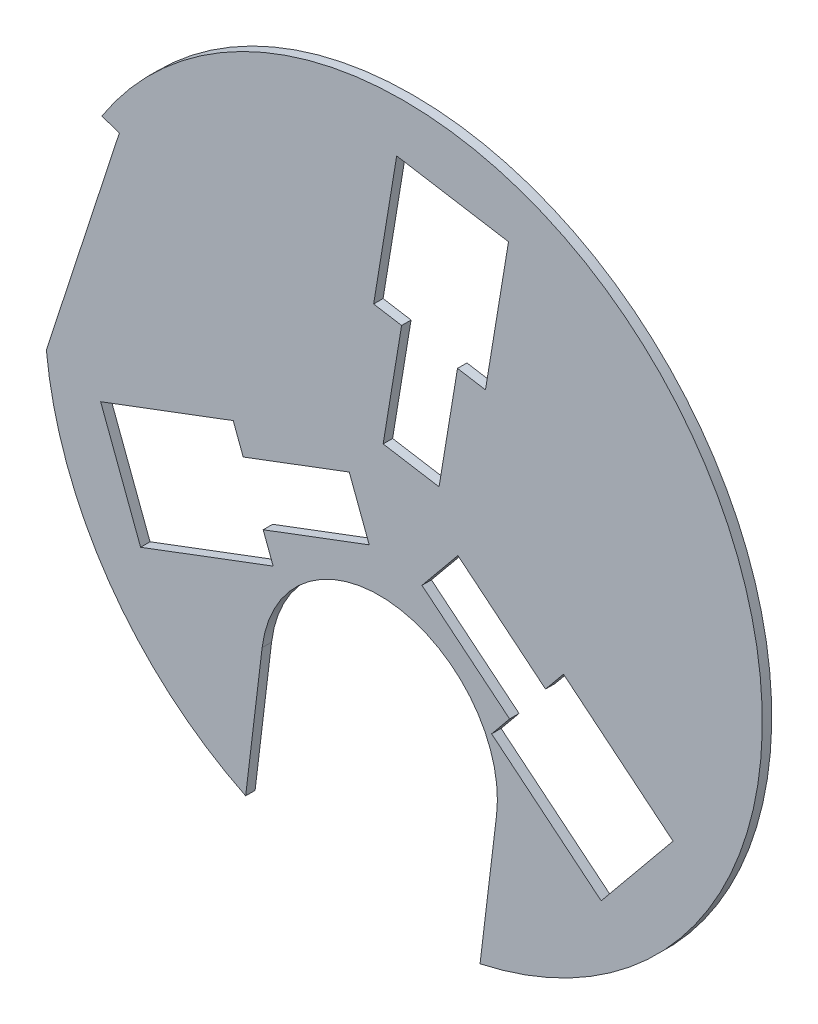
ISO-10303-21;
HEADER;
FILE_DESCRIPTION(('STEP AP214'),'2;1');
FILE_NAME('part.step','',(''),(''),'','','');
FILE_SCHEMA(('AUTOMOTIVE_DESIGN { 1 0 10303 214 1 1 1 1 }'));
ENDSEC;
DATA;
#1=APPLICATION_CONTEXT('core data for automotive mechanical design processes');
#2=APPLICATION_PROTOCOL_DEFINITION('international standard','automotive_design',2000,#1);
#3=PRODUCT_CONTEXT('',#1,'mechanical');
#4=PRODUCT('Part','Part','',(#3));
#5=PRODUCT_RELATED_PRODUCT_CATEGORY('part','',(#4));
#6=PRODUCT_DEFINITION_FORMATION('','',#4);
#7=PRODUCT_DEFINITION_CONTEXT('part definition',#1,'design');
#8=PRODUCT_DEFINITION('design','',#6,#7);
#9=PRODUCT_DEFINITION_SHAPE('','',#8);
#10=(LENGTH_UNIT() NAMED_UNIT(*) SI_UNIT(.MILLI.,.METRE.));
#11=(NAMED_UNIT(*) PLANE_ANGLE_UNIT() SI_UNIT($,.RADIAN.));
#12=(NAMED_UNIT(*) SI_UNIT($,.STERADIAN.) SOLID_ANGLE_UNIT());
#13=UNCERTAINTY_MEASURE_WITH_UNIT(LENGTH_MEASURE(1.E-05),#10,'distance_accuracy_value','');
#14=(GEOMETRIC_REPRESENTATION_CONTEXT(3) GLOBAL_UNCERTAINTY_ASSIGNED_CONTEXT((#13)) GLOBAL_UNIT_ASSIGNED_CONTEXT((#10,
#11,#12)) REPRESENTATION_CONTEXT('',''));
#15=CARTESIAN_POINT('',(0.,0.,0.));
#16=DIRECTION('',(0.,0.,1.));
#17=DIRECTION('',(1.,0.,0.));
#18=AXIS2_PLACEMENT_3D('',#15,#16,#17);
#19=CARTESIAN_POINT('',(0.,0.,5.));
#20=DIRECTION('',(0.,0.,1.));
#21=DIRECTION('',(1.,0.,0.));
#22=AXIS2_PLACEMENT_3D('',#19,#20,#21);
#23=PLANE('',#22);
#24=CARTESIAN_POINT('',(0.,0.,5.));
#25=DIRECTION('',(0.,0.,1.));
#26=DIRECTION('',(1.,0.,0.));
#27=AXIS2_PLACEMENT_3D('',#24,#25,#26);
#28=CIRCLE('',#27,190.);
#29=CARTESIAN_POINT('',(40.570349206141,-185.618013041008,5.));
#30=VERTEX_POINT('',#29);
#31=CARTESIAN_POINT('',(-159.704253128849,102.929837911835,5.));
#32=VERTEX_POINT('',#31);
#33=EDGE_CURVE('E419',#30,#32,#28,.T.);
#34=ORIENTED_EDGE('',*,*,#33,.T.);
#35=DIRECTION('',(0.950945587746188,-0.309358189072241,0.));
#36=VECTOR('',#35,1.);
#37=CARTESIAN_POINT('',(-150.380705264595,99.8967349455023,5.));
#38=LINE('',#37,#36);
#39=CARTESIAN_POINT('',(-150.380705264595,99.8967349455023,5.));
#40=VERTEX_POINT('',#39);
#41=EDGE_CURVE('E422',#32,#40,#38,.T.);
#42=ORIENTED_EDGE('',*,*,#41,.T.);
#43=DIRECTION('',(-0.309358189072243,-0.950945587746188,0.));
#44=VECTOR('',#43,1.);
#45=CARTESIAN_POINT('',(-189.050478898635,-18.9714635228006,5.));
#46=LINE('',#45,#44);
#47=CARTESIAN_POINT('',(-189.050478898635,-18.9714635228006,5.));
#48=VERTEX_POINT('',#47);
#49=EDGE_CURVE('E425',#40,#48,#46,.T.);
#50=ORIENTED_EDGE('',*,*,#49,.T.);
#51=CARTESIAN_POINT('',(0.,0.,5.));
#52=DIRECTION('',(0.,0.,1.));
#53=DIRECTION('',(1.,0.,0.));
#54=AXIS2_PLACEMENT_3D('',#51,#52,#53);
#55=CIRCLE('',#54,190.);
#56=CARTESIAN_POINT('',(-83.5306748229821,-170.6535272522,5.));
#57=VERTEX_POINT('',#56);
#58=EDGE_CURVE('E427',#48,#57,#55,.T.);
#59=ORIENTED_EDGE('',*,*,#58,.T.);
#60=DIRECTION('',(0.119716053921263,0.992808172021928,0.));
#61=VECTOR('',#60,1.);
#62=CARTESIAN_POINT('',(-83.5306748229821,-170.6535272522,5.));
#63=LINE('',#62,#61);
#64=CARTESIAN_POINT('',(-74.8066287928856,-98.3047995078674,5.));
#65=VERTEX_POINT('',#64);
#66=EDGE_CURVE('E429',#57,#65,#63,.T.);
#67=ORIENTED_EDGE('',*,*,#66,.T.);
#68=CARTESIAN_POINT('',(-12.7561167798487,-105.787042414917,5.));
#69=DIRECTION('',(0.,0.,-1.));
#70=DIRECTION('',(1.,0.,0.));
#71=AXIS2_PLACEMENT_3D('',#68,#69,#70);
#72=CIRCLE('',#71,62.5000000000009);
#73=CARTESIAN_POINT('',(49.2943952362377,-113.269285296676,5.));
#74=VERTEX_POINT('',#73);
#75=EDGE_CURVE('E431',#65,#74,#72,.T.);
#76=ORIENTED_EDGE('',*,*,#75,.T.);
#77=DIRECTION('',(-0.119716053921264,-0.992808172021927,0.));
#78=VECTOR('',#77,1.);
#79=CARTESIAN_POINT('',(40.570349206141,-185.618013041008,5.));
#80=LINE('',#79,#78);
#81=EDGE_CURVE('E433',#74,#30,#80,.T.);
#82=ORIENTED_EDGE('',*,*,#81,.T.);
#83=EDGE_LOOP('',(#34,#42,#50,#59,#67,#76,#82));
#84=FACE_BOUND('',#83,.T.);
#85=DIRECTION('',(0.935818277582304,0.35248283836648,0.));
#86=VECTOR('',#85,1.);
#87=CARTESIAN_POINT('',(-139.156439262174,-84.4718024661059,5.));
#88=LINE('',#87,#86);
#89=CARTESIAN_POINT('',(-139.156439262174,-84.4718024661059,5.));
#90=VERTEX_POINT('',#89);
#91=CARTESIAN_POINT('',(-68.9700684435015,-58.0355895886199,5.));
#92=VERTEX_POINT('',#91);
#93=EDGE_CURVE('E362',#90,#92,#88,.T.);
#94=ORIENTED_EDGE('',*,*,#93,.F.);
#95=DIRECTION('',(0.35248283836648,-0.935818277582304,0.));
#96=VECTOR('',#95,1.);
#97=CARTESIAN_POINT('',(-160.305409564163,-28.3227058111676,5.));
#98=LINE('',#97,#96);
#99=CARTESIAN_POINT('',(-160.305409564163,-28.3227058111676,5.));
#100=VERTEX_POINT('',#99);
#101=EDGE_CURVE('E360',#100,#90,#98,.T.);
#102=ORIENTED_EDGE('',*,*,#101,.F.);
#103=DIRECTION('',(-0.935818277582304,-0.352482838366479,0.));
#104=VECTOR('',#103,1.);
#105=CARTESIAN_POINT('',(-160.305409564163,-28.3227058111676,5.));
#106=LINE('',#105,#104);
#107=CARTESIAN_POINT('',(-90.1190387454903,-1.88649293368167,5.));
#108=VERTEX_POINT('',#107);
#109=EDGE_CURVE('E376',#108,#100,#106,.T.);
#110=ORIENTED_EDGE('',*,*,#109,.F.);
#111=DIRECTION('',(-0.352482838366482,0.935818277582303,0.));
#112=VECTOR('',#111,1.);
#113=CARTESIAN_POINT('',(-90.1190387454903,-1.88649293368167,5.));
#114=LINE('',#113,#112);
#115=CARTESIAN_POINT('',(-84.8317961699931,-15.9237670974162,5.));
#116=VERTEX_POINT('',#115);
#117=EDGE_CURVE('E373',#116,#108,#114,.T.);
#118=ORIENTED_EDGE('',*,*,#117,.F.);
#119=DIRECTION('',(-0.935818277582304,-0.352482838366479,0.));
#120=VECTOR('',#119,1.);
#121=CARTESIAN_POINT('',(-84.8317961699931,-15.9237670974162,5.));
#122=LINE('',#121,#120);
#123=CARTESIAN_POINT('',(-28.6826995150548,5.22520320457257,5.));
#124=VERTEX_POINT('',#123);
#125=EDGE_CURVE('E371',#124,#116,#122,.T.);
#126=ORIENTED_EDGE('',*,*,#125,.F.);
#127=DIRECTION('',(-0.35248283836648,0.935818277582304,0.));
#128=VECTOR('',#127,1.);
#129=CARTESIAN_POINT('',(-28.6826995150548,5.22520320457257,5.));
#130=LINE('',#129,#128);
#131=CARTESIAN_POINT('',(-18.1082143640604,-22.8493451228966,5.));
#132=VERTEX_POINT('',#131);
#133=EDGE_CURVE('E369',#132,#124,#130,.T.);
#134=ORIENTED_EDGE('',*,*,#133,.F.);
#135=DIRECTION('',(0.935818277582304,0.35248283836648,0.));
#136=VECTOR('',#135,1.);
#137=CARTESIAN_POINT('',(-74.2573110189986,-43.9983154248853,5.));
#138=LINE('',#137,#136);
#139=CARTESIAN_POINT('',(-74.2573110189986,-43.9983154248853,5.));
#140=VERTEX_POINT('',#139);
#141=EDGE_CURVE('E367',#140,#132,#138,.T.);
#142=ORIENTED_EDGE('',*,*,#141,.F.);
#143=DIRECTION('',(-0.352482838366478,0.935818277582305,0.));
#144=VECTOR('',#143,1.);
#145=CARTESIAN_POINT('',(-74.2573110189986,-43.9983154248853,5.));
#146=LINE('',#145,#144);
#147=EDGE_CURVE('E365',#92,#140,#146,.T.);
#148=ORIENTED_EDGE('',*,*,#147,.F.);
#149=EDGE_LOOP('',(#94,#102,#110,#118,#126,#134,#142,#148));
#150=FACE_BOUND('',#149,.T.);
#151=DIRECTION('',(-0.162650046367733,-0.986683820895313,0.));
#152=VECTOR('',#151,1.);
#153=CARTESIAN_POINT('',(-3.57650720802196,162.748912734283,5.));
#154=LINE('',#153,#152);
#155=CARTESIAN_POINT('',(-3.57650720802196,162.748912734283,5.));
#156=VERTEX_POINT('',#155);
#157=CARTESIAN_POINT('',(-15.7752606856019,88.7476261671346,5.));
#158=VERTEX_POINT('',#157);
#159=EDGE_CURVE('E303',#156,#158,#154,.T.);
#160=ORIENTED_EDGE('',*,*,#159,.F.);
#161=DIRECTION('',(-0.986683820895313,0.162650046367733,0.));
#162=VECTOR('',#161,1.);
#163=CARTESIAN_POINT('',(55.6245220456968,152.989909952219,5.));
#164=LINE('',#163,#162);
#165=CARTESIAN_POINT('',(55.6245220456968,152.989909952219,5.));
#166=VERTEX_POINT('',#165);
#167=EDGE_CURVE('E301',#166,#156,#164,.T.);
#168=ORIENTED_EDGE('',*,*,#167,.F.);
#169=DIRECTION('',(0.162650046367733,0.986683820895313,0.));
#170=VECTOR('',#169,1.);
#171=CARTESIAN_POINT('',(55.6245220456968,152.989909952219,5.));
#172=LINE('',#171,#170);
#173=CARTESIAN_POINT('',(43.4257685681168,78.9886233850706,5.));
#174=VERTEX_POINT('',#173);
#175=EDGE_CURVE('E317',#174,#166,#172,.T.);
#176=ORIENTED_EDGE('',*,*,#175,.F.);
#177=DIRECTION('',(0.986683820895313,-0.162650046367734,0.));
#178=VECTOR('',#177,1.);
#179=CARTESIAN_POINT('',(43.4257685681168,78.9886233850706,5.));
#180=LINE('',#179,#178);
#181=CARTESIAN_POINT('',(28.6255112546872,81.4283740805867,5.));
#182=VERTEX_POINT('',#181);
#183=EDGE_CURVE('E314',#182,#174,#180,.T.);
#184=ORIENTED_EDGE('',*,*,#183,.F.);
#185=DIRECTION('',(0.162650046367733,0.986683820895313,0.));
#186=VECTOR('',#185,1.);
#187=CARTESIAN_POINT('',(28.6255112546872,81.4283740805867,5.));
#188=LINE('',#187,#186);
#189=CARTESIAN_POINT('',(18.866508472623,22.2273448268668,5.));
#190=VERTEX_POINT('',#189);
#191=EDGE_CURVE('E312',#190,#182,#188,.T.);
#192=ORIENTED_EDGE('',*,*,#191,.F.);
#193=DIRECTION('',(0.986683820895313,-0.162650046367733,0.));
#194=VECTOR('',#193,1.);
#195=CARTESIAN_POINT('',(18.866508472623,22.2273448268668,5.));
#196=LINE('',#195,#194);
#197=CARTESIAN_POINT('',(-10.7340061542364,27.1068462178988,5.));
#198=VERTEX_POINT('',#197);
#199=EDGE_CURVE('E310',#198,#190,#196,.T.);
#200=ORIENTED_EDGE('',*,*,#199,.F.);
#201=DIRECTION('',(-0.162650046367733,-0.986683820895313,0.));
#202=VECTOR('',#201,1.);
#203=CARTESIAN_POINT('',(-0.975003372172222,86.3078754716186,5.));
#204=LINE('',#203,#202);
#205=CARTESIAN_POINT('',(-0.975003372172222,86.3078754716186,5.));
#206=VERTEX_POINT('',#205);
#207=EDGE_CURVE('E308',#206,#198,#204,.T.);
#208=ORIENTED_EDGE('',*,*,#207,.F.);
#209=DIRECTION('',(0.986683820895313,-0.162650046367732,0.));
#210=VECTOR('',#209,1.);
#211=CARTESIAN_POINT('',(-0.975003372172222,86.3078754716186,5.));
#212=LINE('',#211,#210);
#213=EDGE_CURVE('E306',#158,#206,#212,.T.);
#214=ORIENTED_EDGE('',*,*,#213,.F.);
#215=EDGE_LOOP('',(#160,#168,#176,#184,#192,#200,#208,#214));
#216=FACE_BOUND('',#215,.T.);
#217=DIRECTION('',(-0.773168231214567,0.634200982528833,0.));
#218=VECTOR('',#217,1.);
#219=CARTESIAN_POINT('',(142.732946470196,-78.2771102681759,5.));
#220=LINE('',#219,#218);
#221=CARTESIAN_POINT('',(142.732946470196,-78.2771102681759,5.));
#222=VERTEX_POINT('',#221);
#223=CARTESIAN_POINT('',(84.7453291291034,-30.7120365785134,5.));
#224=VERTEX_POINT('',#223);
#225=EDGE_CURVE('E244',#222,#224,#220,.T.);
#226=ORIENTED_EDGE('',*,*,#225,.F.);
#227=DIRECTION('',(0.634200982528834,0.773168231214567,0.));
#228=VECTOR('',#227,1.);
#229=CARTESIAN_POINT('',(104.680887518465,-124.667204141051,5.));
#230=LINE('',#229,#228);
#231=CARTESIAN_POINT('',(104.680887518465,-124.667204141051,5.));
#232=VERTEX_POINT('',#231);
#233=EDGE_CURVE('E236',#232,#222,#230,.T.);
#234=ORIENTED_EDGE('',*,*,#233,.F.);
#235=DIRECTION('',(0.773168231214567,-0.634200982528833,0.));
#236=VECTOR('',#235,1.);
#237=CARTESIAN_POINT('',(104.680887518465,-124.667204141051,5.));
#238=LINE('',#237,#236);
#239=CARTESIAN_POINT('',(46.6932701773728,-77.1021304513881,5.));
#240=VERTEX_POINT('',#239);
#241=EDGE_CURVE('E269',#240,#232,#238,.T.);
#242=ORIENTED_EDGE('',*,*,#241,.F.);
#243=DIRECTION('',(-0.634200982528833,-0.773168231214568,0.));
#244=VECTOR('',#243,1.);
#245=CARTESIAN_POINT('',(46.6932701773728,-77.1021304513881,5.));
#246=LINE('',#245,#244);
#247=CARTESIAN_POINT('',(56.2062849153056,-65.5046069831693,5.));
#248=VERTEX_POINT('',#247);
#249=EDGE_CURVE('E267',#248,#240,#246,.T.);
#250=ORIENTED_EDGE('',*,*,#249,.F.);
#251=DIRECTION('',(0.773168231214567,-0.634200982528834,0.));
#252=VECTOR('',#251,1.);
#253=CARTESIAN_POINT('',(56.2062849153056,-65.5046069831693,5.));
#254=LINE('',#253,#252);
#255=CARTESIAN_POINT('',(9.81619104243168,-27.4525480314393,5.));
#256=VERTEX_POINT('',#255);
#257=EDGE_CURVE('E265',#256,#248,#254,.T.);
#258=ORIENTED_EDGE('',*,*,#257,.F.);
#259=DIRECTION('',(-0.634200982528834,-0.773168231214567,0.));
#260=VECTOR('',#259,1.);
#261=CARTESIAN_POINT('',(9.81619104243168,-27.4525480314393,5.));
#262=LINE('',#261,#260);
#263=CARTESIAN_POINT('',(28.8422205182967,-4.25750109500233,5.));
#264=VERTEX_POINT('',#263);
#265=EDGE_CURVE('E263',#264,#256,#262,.T.);
#266=ORIENTED_EDGE('',*,*,#265,.F.);
#267=DIRECTION('',(-0.773168231214567,0.634200982528834,0.));
#268=VECTOR('',#267,1.);
#269=CARTESIAN_POINT('',(75.2323143911706,-42.3095600467323,5.));
#270=LINE('',#269,#268);
#271=CARTESIAN_POINT('',(75.2323143911706,-42.3095600467323,5.));
#272=VERTEX_POINT('',#271);
#273=EDGE_CURVE('E259',#272,#264,#270,.T.);
#274=ORIENTED_EDGE('',*,*,#273,.F.);
#275=DIRECTION('',(-0.634200982528834,-0.773168231214567,0.));
#276=VECTOR('',#275,1.);
#277=CARTESIAN_POINT('',(75.2323143911706,-42.3095600467323,5.));
#278=LINE('',#277,#276);
#279=EDGE_CURVE('E257',#224,#272,#278,.T.);
#280=ORIENTED_EDGE('',*,*,#279,.F.);
#281=EDGE_LOOP('',(#226,#234,#242,#250,#258,#266,#274,#280));
#282=FACE_BOUND('',#281,.T.);
#283=ADVANCED_FACE('F33',(#84,#150,#216,#282),#23,.T.);
#284=CARTESIAN_POINT('',(0.,0.,0.));
#285=DIRECTION('',(0.,0.,1.));
#286=DIRECTION('',(1.,0.,0.));
#287=AXIS2_PLACEMENT_3D('',#284,#285,#286);
#288=PLANE('',#287);
#289=DIRECTION('',(-0.986683820895313,0.162650046367733,0.));
#290=VECTOR('',#289,1.);
#291=CARTESIAN_POINT('',(55.6245220456968,152.989909952219,0.));
#292=LINE('',#291,#290);
#293=CARTESIAN_POINT('',(55.6245220456968,152.989909952219,0.));
#294=VERTEX_POINT('',#293);
#295=CARTESIAN_POINT('',(-3.57650720802196,162.748912734283,0.));
#296=VERTEX_POINT('',#295);
#297=EDGE_CURVE('E252',#294,#296,#292,.T.);
#298=ORIENTED_EDGE('',*,*,#297,.T.);
#299=DIRECTION('',(-0.162650046367733,-0.986683820895313,0.));
#300=VECTOR('',#299,1.);
#301=CARTESIAN_POINT('',(-3.57650720802196,162.748912734283,0.));
#302=LINE('',#301,#300);
#303=CARTESIAN_POINT('',(-15.7752606856019,88.7476261671346,0.));
#304=VERTEX_POINT('',#303);
#305=EDGE_CURVE('E322',#296,#304,#302,.T.);
#306=ORIENTED_EDGE('',*,*,#305,.T.);
#307=DIRECTION('',(0.986683820895313,-0.162650046367732,0.));
#308=VECTOR('',#307,1.);
#309=CARTESIAN_POINT('',(-0.975003372172222,86.3078754716186,0.));
#310=LINE('',#309,#308);
#311=CARTESIAN_POINT('',(-0.975003372172222,86.3078754716186,0.));
#312=VERTEX_POINT('',#311);
#313=EDGE_CURVE('E325',#304,#312,#310,.T.);
#314=ORIENTED_EDGE('',*,*,#313,.T.);
#315=DIRECTION('',(-0.162650046367733,-0.986683820895313,0.));
#316=VECTOR('',#315,1.);
#317=CARTESIAN_POINT('',(-0.975003372172222,86.3078754716186,0.));
#318=LINE('',#317,#316);
#319=CARTESIAN_POINT('',(-10.7340061542364,27.1068462178988,0.));
#320=VERTEX_POINT('',#319);
#321=EDGE_CURVE('E328',#312,#320,#318,.T.);
#322=ORIENTED_EDGE('',*,*,#321,.T.);
#323=DIRECTION('',(0.986683820895313,-0.162650046367733,0.));
#324=VECTOR('',#323,1.);
#325=CARTESIAN_POINT('',(18.866508472623,22.2273448268668,0.));
#326=LINE('',#325,#324);
#327=CARTESIAN_POINT('',(18.866508472623,22.2273448268668,0.));
#328=VERTEX_POINT('',#327);
#329=EDGE_CURVE('E331',#320,#328,#326,.T.);
#330=ORIENTED_EDGE('',*,*,#329,.T.);
#331=DIRECTION('',(0.162650046367733,0.986683820895313,0.));
#332=VECTOR('',#331,1.);
#333=CARTESIAN_POINT('',(28.6255112546872,81.4283740805867,0.));
#334=LINE('',#333,#332);
#335=CARTESIAN_POINT('',(28.6255112546872,81.4283740805867,0.));
#336=VERTEX_POINT('',#335);
#337=EDGE_CURVE('E334',#328,#336,#334,.T.);
#338=ORIENTED_EDGE('',*,*,#337,.T.);
#339=DIRECTION('',(0.986683820895313,-0.162650046367734,0.));
#340=VECTOR('',#339,1.);
#341=CARTESIAN_POINT('',(43.4257685681168,78.9886233850706,0.));
#342=LINE('',#341,#340);
#343=CARTESIAN_POINT('',(43.4257685681168,78.9886233850706,0.));
#344=VERTEX_POINT('',#343);
#345=EDGE_CURVE('E337',#336,#344,#342,.T.);
#346=ORIENTED_EDGE('',*,*,#345,.T.);
#347=DIRECTION('',(0.162650046367733,0.986683820895313,0.));
#348=VECTOR('',#347,1.);
#349=CARTESIAN_POINT('',(55.6245220456968,152.989909952219,0.));
#350=LINE('',#349,#348);
#351=EDGE_CURVE('E304',#344,#294,#350,.T.);
#352=ORIENTED_EDGE('',*,*,#351,.T.);
#353=EDGE_LOOP('',(#298,#306,#314,#322,#330,#338,#346,#352));
#354=FACE_BOUND('',#353,.T.);
#355=CARTESIAN_POINT('',(0.,0.,0.));
#356=DIRECTION('',(0.,0.,1.));
#357=DIRECTION('',(1.,0.,0.));
#358=AXIS2_PLACEMENT_3D('',#355,#356,#357);
#359=CIRCLE('',#358,190.);
#360=CARTESIAN_POINT('',(40.570349206141,-185.618013041008,0.));
#361=VERTEX_POINT('',#360);
#362=CARTESIAN_POINT('',(-159.704253128849,102.929837911835,0.));
#363=VERTEX_POINT('',#362);
#364=EDGE_CURVE('E418',#361,#363,#359,.T.);
#365=ORIENTED_EDGE('',*,*,#364,.F.);
#366=DIRECTION('',(-0.119716053921264,-0.992808172021927,0.));
#367=VECTOR('',#366,1.);
#368=CARTESIAN_POINT('',(40.570349206141,-185.618013041008,0.));
#369=LINE('',#368,#367);
#370=CARTESIAN_POINT('',(49.2943952362377,-113.269285296676,0.));
#371=VERTEX_POINT('',#370);
#372=EDGE_CURVE('E423',#371,#361,#369,.T.);
#373=ORIENTED_EDGE('',*,*,#372,.F.);
#374=CARTESIAN_POINT('',(-12.7561167798487,-105.787042414917,0.));
#375=DIRECTION('',(0.,0.,-1.));
#376=DIRECTION('',(1.,0.,0.));
#377=AXIS2_PLACEMENT_3D('',#374,#375,#376);
#378=CIRCLE('',#377,62.5000000000009);
#379=CARTESIAN_POINT('',(-74.8066287928856,-98.3047995078674,0.));
#380=VERTEX_POINT('',#379);
#381=EDGE_CURVE('E446',#380,#371,#378,.T.);
#382=ORIENTED_EDGE('',*,*,#381,.F.);
#383=DIRECTION('',(0.119716053921263,0.992808172021928,0.));
#384=VECTOR('',#383,1.);
#385=CARTESIAN_POINT('',(-83.5306748229821,-170.6535272522,0.));
#386=LINE('',#385,#384);
#387=CARTESIAN_POINT('',(-83.5306748229821,-170.6535272522,0.));
#388=VERTEX_POINT('',#387);
#389=EDGE_CURVE('E444',#388,#380,#386,.T.);
#390=ORIENTED_EDGE('',*,*,#389,.F.);
#391=CARTESIAN_POINT('',(0.,0.,0.));
#392=DIRECTION('',(0.,0.,1.));
#393=DIRECTION('',(1.,0.,0.));
#394=AXIS2_PLACEMENT_3D('',#391,#392,#393);
#395=CIRCLE('',#394,190.);
#396=CARTESIAN_POINT('',(-189.050478898635,-18.9714635228006,0.));
#397=VERTEX_POINT('',#396);
#398=EDGE_CURVE('E442',#397,#388,#395,.T.);
#399=ORIENTED_EDGE('',*,*,#398,.F.);
#400=DIRECTION('',(-0.309358189072243,-0.950945587746188,0.));
#401=VECTOR('',#400,1.);
#402=CARTESIAN_POINT('',(-189.050478898635,-18.9714635228006,0.));
#403=LINE('',#402,#401);
#404=CARTESIAN_POINT('',(-150.380705264595,99.8967349455023,0.));
#405=VERTEX_POINT('',#404);
#406=EDGE_CURVE('E440',#405,#397,#403,.T.);
#407=ORIENTED_EDGE('',*,*,#406,.F.);
#408=DIRECTION('',(0.950945587746188,-0.309358189072241,0.));
#409=VECTOR('',#408,1.);
#410=CARTESIAN_POINT('',(-150.380705264595,99.8967349455023,0.));
#411=LINE('',#410,#409);
#412=EDGE_CURVE('E438',#363,#405,#411,.T.);
#413=ORIENTED_EDGE('',*,*,#412,.F.);
#414=EDGE_LOOP('',(#365,#373,#382,#390,#399,#407,#413));
#415=FACE_BOUND('',#414,.T.);
#416=DIRECTION('',(0.35248283836648,-0.935818277582304,0.));
#417=VECTOR('',#416,1.);
#418=CARTESIAN_POINT('',(-160.305409564163,-28.3227058111676,0.));
#419=LINE('',#418,#417);
#420=CARTESIAN_POINT('',(-160.305409564163,-28.3227058111676,0.));
#421=VERTEX_POINT('',#420);
#422=CARTESIAN_POINT('',(-139.156439262174,-84.4718024661059,0.));
#423=VERTEX_POINT('',#422);
#424=EDGE_CURVE('E359',#421,#423,#419,.T.);
#425=ORIENTED_EDGE('',*,*,#424,.T.);
#426=DIRECTION('',(0.935818277582304,0.35248283836648,0.));
#427=VECTOR('',#426,1.);
#428=CARTESIAN_POINT('',(-139.156439262174,-84.4718024661059,0.));
#429=LINE('',#428,#427);
#430=CARTESIAN_POINT('',(-68.9700684435015,-58.0355895886199,0.));
#431=VERTEX_POINT('',#430);
#432=EDGE_CURVE('E381',#423,#431,#429,.T.);
#433=ORIENTED_EDGE('',*,*,#432,.T.);
#434=DIRECTION('',(-0.352482838366478,0.935818277582305,0.));
#435=VECTOR('',#434,1.);
#436=CARTESIAN_POINT('',(-74.2573110189986,-43.9983154248853,0.));
#437=LINE('',#436,#435);
#438=CARTESIAN_POINT('',(-74.2573110189986,-43.9983154248853,0.));
#439=VERTEX_POINT('',#438);
#440=EDGE_CURVE('E384',#431,#439,#437,.T.);
#441=ORIENTED_EDGE('',*,*,#440,.T.);
#442=DIRECTION('',(0.935818277582304,0.35248283836648,0.));
#443=VECTOR('',#442,1.);
#444=CARTESIAN_POINT('',(-74.2573110189986,-43.9983154248853,0.));
#445=LINE('',#444,#443);
#446=CARTESIAN_POINT('',(-18.1082143640604,-22.8493451228966,0.));
#447=VERTEX_POINT('',#446);
#448=EDGE_CURVE('E387',#439,#447,#445,.T.);
#449=ORIENTED_EDGE('',*,*,#448,.T.);
#450=DIRECTION('',(-0.35248283836648,0.935818277582304,0.));
#451=VECTOR('',#450,1.);
#452=CARTESIAN_POINT('',(-28.6826995150548,5.22520320457257,0.));
#453=LINE('',#452,#451);
#454=CARTESIAN_POINT('',(-28.6826995150548,5.22520320457257,0.));
#455=VERTEX_POINT('',#454);
#456=EDGE_CURVE('E390',#447,#455,#453,.T.);
#457=ORIENTED_EDGE('',*,*,#456,.T.);
#458=DIRECTION('',(-0.935818277582304,-0.352482838366479,0.));
#459=VECTOR('',#458,1.);
#460=CARTESIAN_POINT('',(-84.8317961699931,-15.9237670974162,0.));
#461=LINE('',#460,#459);
#462=CARTESIAN_POINT('',(-84.8317961699931,-15.9237670974162,0.));
#463=VERTEX_POINT('',#462);
#464=EDGE_CURVE('E393',#455,#463,#461,.T.);
#465=ORIENTED_EDGE('',*,*,#464,.T.);
#466=DIRECTION('',(-0.352482838366482,0.935818277582303,0.));
#467=VECTOR('',#466,1.);
#468=CARTESIAN_POINT('',(-90.1190387454903,-1.88649293368167,0.));
#469=LINE('',#468,#467);
#470=CARTESIAN_POINT('',(-90.1190387454903,-1.88649293368167,0.));
#471=VERTEX_POINT('',#470);
#472=EDGE_CURVE('E396',#463,#471,#469,.T.);
#473=ORIENTED_EDGE('',*,*,#472,.T.);
#474=DIRECTION('',(-0.935818277582304,-0.352482838366479,0.));
#475=VECTOR('',#474,1.);
#476=CARTESIAN_POINT('',(-160.305409564163,-28.3227058111676,0.));
#477=LINE('',#476,#475);
#478=EDGE_CURVE('E363',#471,#421,#477,.T.);
#479=ORIENTED_EDGE('',*,*,#478,.T.);
#480=EDGE_LOOP('',(#425,#433,#441,#449,#457,#465,#473,#479));
#481=FACE_BOUND('',#480,.T.);
#482=DIRECTION('',(0.634200982528834,0.773168231214567,0.));
#483=VECTOR('',#482,1.);
#484=CARTESIAN_POINT('',(104.680887518465,-124.667204141051,0.));
#485=LINE('',#484,#483);
#486=CARTESIAN_POINT('',(104.680887518465,-124.667204141051,0.));
#487=VERTEX_POINT('',#486);
#488=CARTESIAN_POINT('',(142.732946470196,-78.2771102681759,0.));
#489=VERTEX_POINT('',#488);
#490=EDGE_CURVE('E56',#487,#489,#485,.T.);
#491=ORIENTED_EDGE('',*,*,#490,.T.);
#492=DIRECTION('',(-0.773168231214567,0.634200982528833,0.));
#493=VECTOR('',#492,1.);
#494=CARTESIAN_POINT('',(142.732946470196,-78.2771102681759,0.));
#495=LINE('',#494,#493);
#496=CARTESIAN_POINT('',(84.7453291291034,-30.7120365785134,0.));
#497=VERTEX_POINT('',#496);
#498=EDGE_CURVE('E251',#489,#497,#495,.T.);
#499=ORIENTED_EDGE('',*,*,#498,.T.);
#500=DIRECTION('',(-0.634200982528834,-0.773168231214567,0.));
#501=VECTOR('',#500,1.);
#502=CARTESIAN_POINT('',(75.2323143911706,-42.3095600467323,0.));
#503=LINE('',#502,#501);
#504=CARTESIAN_POINT('',(75.2323143911706,-42.3095600467323,0.));
#505=VERTEX_POINT('',#504);
#506=EDGE_CURVE('E273',#497,#505,#503,.T.);
#507=ORIENTED_EDGE('',*,*,#506,.T.);
#508=DIRECTION('',(-0.773168231214567,0.634200982528834,0.));
#509=VECTOR('',#508,1.);
#510=CARTESIAN_POINT('',(75.2323143911706,-42.3095600467323,0.));
#511=LINE('',#510,#509);
#512=CARTESIAN_POINT('',(28.8422205182967,-4.25750109500233,0.));
#513=VERTEX_POINT('',#512);
#514=EDGE_CURVE('E276',#505,#513,#511,.T.);
#515=ORIENTED_EDGE('',*,*,#514,.T.);
#516=DIRECTION('',(-0.634200982528834,-0.773168231214567,0.));
#517=VECTOR('',#516,1.);
#518=CARTESIAN_POINT('',(9.81619104243168,-27.4525480314393,0.));
#519=LINE('',#518,#517);
#520=CARTESIAN_POINT('',(9.81619104243168,-27.4525480314393,0.));
#521=VERTEX_POINT('',#520);
#522=EDGE_CURVE('E279',#513,#521,#519,.T.);
#523=ORIENTED_EDGE('',*,*,#522,.T.);
#524=DIRECTION('',(0.773168231214567,-0.634200982528834,0.));
#525=VECTOR('',#524,1.);
#526=CARTESIAN_POINT('',(56.2062849153056,-65.5046069831693,0.));
#527=LINE('',#526,#525);
#528=CARTESIAN_POINT('',(56.2062849153056,-65.5046069831693,0.));
#529=VERTEX_POINT('',#528);
#530=EDGE_CURVE('E282',#521,#529,#527,.T.);
#531=ORIENTED_EDGE('',*,*,#530,.T.);
#532=DIRECTION('',(-0.634200982528833,-0.773168231214568,0.));
#533=VECTOR('',#532,1.);
#534=CARTESIAN_POINT('',(46.6932701773728,-77.1021304513881,0.));
#535=LINE('',#534,#533);
#536=CARTESIAN_POINT('',(46.6932701773728,-77.1021304513881,0.));
#537=VERTEX_POINT('',#536);
#538=EDGE_CURVE('E285',#529,#537,#535,.T.);
#539=ORIENTED_EDGE('',*,*,#538,.T.);
#540=DIRECTION('',(0.773168231214567,-0.634200982528833,0.));
#541=VECTOR('',#540,1.);
#542=CARTESIAN_POINT('',(104.680887518465,-124.667204141051,0.));
#543=LINE('',#542,#541);
#544=EDGE_CURVE('E245',#537,#487,#543,.T.);
#545=ORIENTED_EDGE('',*,*,#544,.T.);
#546=EDGE_LOOP('',(#491,#499,#507,#515,#523,#531,#539,#545));
#547=FACE_BOUND('',#546,.T.);
#548=ADVANCED_FACE('F473',(#354,#415,#481,#547),#288,.F.);
#549=CARTESIAN_POINT('',(0.,0.,5.));
#550=DIRECTION('',(0.,0.,-1.));
#551=DIRECTION('',(-1.,0.,0.));
#552=AXIS2_PLACEMENT_3D('',#549,#550,#551);
#553=CYLINDRICAL_SURFACE('',#552,190.);
#554=ORIENTED_EDGE('',*,*,#364,.T.);
#555=DIRECTION('',(0.,0.,-1.));
#556=VECTOR('',#555,1.);
#557=CARTESIAN_POINT('',(-159.704253128849,102.929837911835,5.));
#558=LINE('',#557,#556);
#559=EDGE_CURVE('E11',#32,#363,#558,.T.);
#560=ORIENTED_EDGE('',*,*,#559,.F.);
#561=ORIENTED_EDGE('',*,*,#33,.F.);
#562=DIRECTION('',(0.,0.,-1.));
#563=VECTOR('',#562,1.);
#564=CARTESIAN_POINT('',(40.570349206141,-185.618013041008,5.));
#565=LINE('',#564,#563);
#566=EDGE_CURVE('E435',#30,#361,#565,.T.);
#567=ORIENTED_EDGE('',*,*,#566,.T.);
#568=EDGE_LOOP('',(#554,#560,#561,#567));
#569=FACE_BOUND('',#568,.T.);
#570=ADVANCED_FACE('F35',(#569),#553,.T.);
#571=CARTESIAN_POINT('',(-150.380705264595,99.8967349455023,5.));
#572=DIRECTION('',(0.309358189072241,0.950945587746188,0.));
#573=DIRECTION('',(-0.950945587746188,0.309358189072241,0.));
#574=AXIS2_PLACEMENT_3D('',#571,#572,#573);
#575=PLANE('',#574);
#576=ORIENTED_EDGE('',*,*,#412,.T.);
#577=DIRECTION('',(0.,0.,-1.));
#578=VECTOR('',#577,1.);
#579=CARTESIAN_POINT('',(-150.380705264595,99.8967349455023,5.));
#580=LINE('',#579,#578);
#581=EDGE_CURVE('E41',#40,#405,#580,.T.);
#582=ORIENTED_EDGE('',*,*,#581,.F.);
#583=ORIENTED_EDGE('',*,*,#41,.F.);
#584=ORIENTED_EDGE('',*,*,#559,.T.);
#585=EDGE_LOOP('',(#576,#582,#583,#584));
#586=FACE_BOUND('',#585,.T.);
#587=ADVANCED_FACE('F491',(#586),#575,.F.);
#588=CARTESIAN_POINT('',(-189.050478898635,-18.9714635228006,5.));
#589=DIRECTION('',(0.950945587746188,-0.309358189072243,0.));
#590=DIRECTION('',(0.309358189072243,0.950945587746188,0.));
#591=AXIS2_PLACEMENT_3D('',#588,#589,#590);
#592=PLANE('',#591);
#593=ORIENTED_EDGE('',*,*,#406,.T.);
#594=DIRECTION('',(0.,0.,-1.));
#595=VECTOR('',#594,1.);
#596=CARTESIAN_POINT('',(-189.050478898635,-18.9714635228006,5.));
#597=LINE('',#596,#595);
#598=EDGE_CURVE('E460',#48,#397,#597,.T.);
#599=ORIENTED_EDGE('',*,*,#598,.F.);
#600=ORIENTED_EDGE('',*,*,#49,.F.);
#601=ORIENTED_EDGE('',*,*,#581,.T.);
#602=EDGE_LOOP('',(#593,#599,#600,#601));
#603=FACE_BOUND('',#602,.T.);
#604=ADVANCED_FACE('F467',(#603),#592,.F.);
#605=CARTESIAN_POINT('',(0.,0.,5.));
#606=DIRECTION('',(0.,0.,-1.));
#607=DIRECTION('',(-1.,0.,0.));
#608=AXIS2_PLACEMENT_3D('',#605,#606,#607);
#609=CYLINDRICAL_SURFACE('',#608,190.);
#610=ORIENTED_EDGE('',*,*,#398,.T.);
#611=DIRECTION('',(0.,0.,-1.));
#612=VECTOR('',#611,1.);
#613=CARTESIAN_POINT('',(-83.5306748229821,-170.6535272522,5.));
#614=LINE('',#613,#612);
#615=EDGE_CURVE('E457',#57,#388,#614,.T.);
#616=ORIENTED_EDGE('',*,*,#615,.F.);
#617=ORIENTED_EDGE('',*,*,#58,.F.);
#618=ORIENTED_EDGE('',*,*,#598,.T.);
#619=EDGE_LOOP('',(#610,#616,#617,#618));
#620=FACE_BOUND('',#619,.T.);
#621=ADVANCED_FACE('F479',(#620),#609,.T.);
#622=CARTESIAN_POINT('',(-83.5306748229821,-170.6535272522,5.));
#623=DIRECTION('',(-0.992808172021928,0.119716053921263,0.));
#624=DIRECTION('',(-0.119716053921263,-0.992808172021928,0.));
#625=AXIS2_PLACEMENT_3D('',#622,#623,#624);
#626=PLANE('',#625);
#627=ORIENTED_EDGE('',*,*,#389,.T.);
#628=DIRECTION('',(0.,0.,-1.));
#629=VECTOR('',#628,1.);
#630=CARTESIAN_POINT('',(-74.8066287928856,-98.3047995078674,5.));
#631=LINE('',#630,#629);
#632=EDGE_CURVE('E454',#65,#380,#631,.T.);
#633=ORIENTED_EDGE('',*,*,#632,.F.);
#634=ORIENTED_EDGE('',*,*,#66,.F.);
#635=ORIENTED_EDGE('',*,*,#615,.T.);
#636=EDGE_LOOP('',(#627,#633,#634,#635));
#637=FACE_BOUND('',#636,.T.);
#638=ADVANCED_FACE('F483',(#637),#626,.F.);
#639=CARTESIAN_POINT('',(-12.7561167798487,-105.787042414917,5.));
#640=DIRECTION('',(0.,0.,-1.));
#641=DIRECTION('',(-1.,0.,0.));
#642=AXIS2_PLACEMENT_3D('',#639,#640,#641);
#643=CYLINDRICAL_SURFACE('',#642,62.5000000000009);
#644=ORIENTED_EDGE('',*,*,#381,.T.);
#645=DIRECTION('',(0.,0.,-1.));
#646=VECTOR('',#645,1.);
#647=CARTESIAN_POINT('',(49.2943952362377,-113.269285296676,5.));
#648=LINE('',#647,#646);
#649=EDGE_CURVE('E451',#74,#371,#648,.T.);
#650=ORIENTED_EDGE('',*,*,#649,.F.);
#651=ORIENTED_EDGE('',*,*,#75,.F.);
#652=ORIENTED_EDGE('',*,*,#632,.T.);
#653=EDGE_LOOP('',(#644,#650,#651,#652));
#654=FACE_BOUND('',#653,.T.);
#655=ADVANCED_FACE('F499',(#654),#643,.F.);
#656=CARTESIAN_POINT('',(40.570349206141,-185.618013041008,5.));
#657=DIRECTION('',(0.992808172021928,-0.119716053921264,0.));
#658=DIRECTION('',(0.119716053921264,0.992808172021928,0.));
#659=AXIS2_PLACEMENT_3D('',#656,#657,#658);
#660=PLANE('',#659);
#661=ORIENTED_EDGE('',*,*,#372,.T.);
#662=ORIENTED_EDGE('',*,*,#566,.F.);
#663=ORIENTED_EDGE('',*,*,#81,.F.);
#664=ORIENTED_EDGE('',*,*,#649,.T.);
#665=EDGE_LOOP('',(#661,#662,#663,#664));
#666=FACE_BOUND('',#665,.T.);
#667=ADVANCED_FACE('F496',(#666),#660,.F.);
#668=CARTESIAN_POINT('',(-160.305409564163,-28.3227058111676,5.));
#669=DIRECTION('',(0.935818277582304,0.35248283836648,0.));
#670=DIRECTION('',(-0.35248283836648,0.935818277582304,0.));
#671=AXIS2_PLACEMENT_3D('',#668,#669,#670);
#672=PLANE('',#671);
#673=ORIENTED_EDGE('',*,*,#424,.F.);
#674=DIRECTION('',(0.,0.,-1.));
#675=VECTOR('',#674,1.);
#676=CARTESIAN_POINT('',(-160.305409564163,-28.3227058111676,5.));
#677=LINE('',#676,#675);
#678=EDGE_CURVE('E378',#100,#421,#677,.T.);
#679=ORIENTED_EDGE('',*,*,#678,.F.);
#680=ORIENTED_EDGE('',*,*,#101,.T.);
#681=DIRECTION('',(0.,0.,-1.));
#682=VECTOR('',#681,1.);
#683=CARTESIAN_POINT('',(-139.156439262174,-84.4718024661059,5.));
#684=LINE('',#683,#682);
#685=EDGE_CURVE('E415',#90,#423,#684,.T.);
#686=ORIENTED_EDGE('',*,*,#685,.T.);
#687=EDGE_LOOP('',(#673,#679,#680,#686));
#688=FACE_BOUND('',#687,.T.);
#689=ADVANCED_FACE('F506',(#688),#672,.T.);
#690=CARTESIAN_POINT('',(-139.156439262174,-84.4718024661059,5.));
#691=DIRECTION('',(-0.35248283836648,0.935818277582304,0.));
#692=DIRECTION('',(-0.935818277582304,-0.35248283836648,0.));
#693=AXIS2_PLACEMENT_3D('',#690,#691,#692);
#694=PLANE('',#693);
#695=ORIENTED_EDGE('',*,*,#432,.F.);
#696=ORIENTED_EDGE('',*,*,#685,.F.);
#697=ORIENTED_EDGE('',*,*,#93,.T.);
#698=DIRECTION('',(0.,0.,-1.));
#699=VECTOR('',#698,1.);
#700=CARTESIAN_POINT('',(-68.9700684435015,-58.0355895886199,5.));
#701=LINE('',#700,#699);
#702=EDGE_CURVE('E413',#92,#431,#701,.T.);
#703=ORIENTED_EDGE('',*,*,#702,.T.);
#704=EDGE_LOOP('',(#695,#696,#697,#703));
#705=FACE_BOUND('',#704,.T.);
#706=ADVANCED_FACE('F519',(#705),#694,.T.);
#707=CARTESIAN_POINT('',(-74.2573110189986,-43.9983154248853,5.));
#708=DIRECTION('',(-0.935818277582305,-0.352482838366478,0.));
#709=DIRECTION('',(0.352482838366478,-0.935818277582305,0.));
#710=AXIS2_PLACEMENT_3D('',#707,#708,#709);
#711=PLANE('',#710);
#712=ORIENTED_EDGE('',*,*,#440,.F.);
#713=ORIENTED_EDGE('',*,*,#702,.F.);
#714=ORIENTED_EDGE('',*,*,#147,.T.);
#715=DIRECTION('',(0.,0.,-1.));
#716=VECTOR('',#715,1.);
#717=CARTESIAN_POINT('',(-74.2573110189986,-43.9983154248853,5.));
#718=LINE('',#717,#716);
#719=EDGE_CURVE('E411',#140,#439,#718,.T.);
#720=ORIENTED_EDGE('',*,*,#719,.T.);
#721=EDGE_LOOP('',(#712,#713,#714,#720));
#722=FACE_BOUND('',#721,.T.);
#723=ADVANCED_FACE('F523',(#722),#711,.T.);
#724=CARTESIAN_POINT('',(-74.2573110189986,-43.9983154248853,5.));
#725=DIRECTION('',(-0.35248283836648,0.935818277582304,0.));
#726=DIRECTION('',(-0.935818277582304,-0.35248283836648,0.));
#727=AXIS2_PLACEMENT_3D('',#724,#725,#726);
#728=PLANE('',#727);
#729=ORIENTED_EDGE('',*,*,#448,.F.);
#730=ORIENTED_EDGE('',*,*,#719,.F.);
#731=ORIENTED_EDGE('',*,*,#141,.T.);
#732=DIRECTION('',(0.,0.,-1.));
#733=VECTOR('',#732,1.);
#734=CARTESIAN_POINT('',(-18.1082143640604,-22.8493451228966,5.));
#735=LINE('',#734,#733);
#736=EDGE_CURVE('E409',#132,#447,#735,.T.);
#737=ORIENTED_EDGE('',*,*,#736,.T.);
#738=EDGE_LOOP('',(#729,#730,#731,#737));
#739=FACE_BOUND('',#738,.T.);
#740=ADVANCED_FACE('F527',(#739),#728,.T.);
#741=CARTESIAN_POINT('',(-28.6826995150548,5.22520320457257,5.));
#742=DIRECTION('',(-0.935818277582304,-0.35248283836648,0.));
#743=DIRECTION('',(0.35248283836648,-0.935818277582304,0.));
#744=AXIS2_PLACEMENT_3D('',#741,#742,#743);
#745=PLANE('',#744);
#746=ORIENTED_EDGE('',*,*,#456,.F.);
#747=ORIENTED_EDGE('',*,*,#736,.F.);
#748=ORIENTED_EDGE('',*,*,#133,.T.);
#749=DIRECTION('',(0.,0.,-1.));
#750=VECTOR('',#749,1.);
#751=CARTESIAN_POINT('',(-28.6826995150548,5.22520320457257,5.));
#752=LINE('',#751,#750);
#753=EDGE_CURVE('E407',#124,#455,#752,.T.);
#754=ORIENTED_EDGE('',*,*,#753,.T.);
#755=EDGE_LOOP('',(#746,#747,#748,#754));
#756=FACE_BOUND('',#755,.T.);
#757=ADVANCED_FACE('F531',(#756),#745,.T.);
#758=CARTESIAN_POINT('',(-84.8317961699931,-15.9237670974162,5.));
#759=DIRECTION('',(0.352482838366479,-0.935818277582304,0.));
#760=DIRECTION('',(0.935818277582304,0.352482838366479,0.));
#761=AXIS2_PLACEMENT_3D('',#758,#759,#760);
#762=PLANE('',#761);
#763=ORIENTED_EDGE('',*,*,#464,.F.);
#764=ORIENTED_EDGE('',*,*,#753,.F.);
#765=ORIENTED_EDGE('',*,*,#125,.T.);
#766=DIRECTION('',(0.,0.,-1.));
#767=VECTOR('',#766,1.);
#768=CARTESIAN_POINT('',(-84.8317961699931,-15.9237670974162,5.));
#769=LINE('',#768,#767);
#770=EDGE_CURVE('E405',#116,#463,#769,.T.);
#771=ORIENTED_EDGE('',*,*,#770,.T.);
#772=EDGE_LOOP('',(#763,#764,#765,#771));
#773=FACE_BOUND('',#772,.T.);
#774=ADVANCED_FACE('F535',(#773),#762,.T.);
#775=CARTESIAN_POINT('',(-90.1190387454903,-1.88649293368167,5.));
#776=DIRECTION('',(-0.935818277582303,-0.352482838366482,0.));
#777=DIRECTION('',(0.352482838366482,-0.935818277582303,0.));
#778=AXIS2_PLACEMENT_3D('',#775,#776,#777);
#779=PLANE('',#778);
#780=ORIENTED_EDGE('',*,*,#472,.F.);
#781=ORIENTED_EDGE('',*,*,#770,.F.);
#782=ORIENTED_EDGE('',*,*,#117,.T.);
#783=DIRECTION('',(0.,0.,-1.));
#784=VECTOR('',#783,1.);
#785=CARTESIAN_POINT('',(-90.1190387454903,-1.88649293368167,5.));
#786=LINE('',#785,#784);
#787=EDGE_CURVE('E403',#108,#471,#786,.T.);
#788=ORIENTED_EDGE('',*,*,#787,.T.);
#789=EDGE_LOOP('',(#780,#781,#782,#788));
#790=FACE_BOUND('',#789,.T.);
#791=ADVANCED_FACE('F539',(#790),#779,.T.);
#792=CARTESIAN_POINT('',(-160.305409564163,-28.3227058111676,5.));
#793=DIRECTION('',(0.352482838366479,-0.935818277582304,0.));
#794=DIRECTION('',(0.935818277582304,0.352482838366479,0.));
#795=AXIS2_PLACEMENT_3D('',#792,#793,#794);
#796=PLANE('',#795);
#797=ORIENTED_EDGE('',*,*,#478,.F.);
#798=ORIENTED_EDGE('',*,*,#787,.F.);
#799=ORIENTED_EDGE('',*,*,#109,.T.);
#800=ORIENTED_EDGE('',*,*,#678,.T.);
#801=EDGE_LOOP('',(#797,#798,#799,#800));
#802=FACE_BOUND('',#801,.T.);
#803=ADVANCED_FACE('F543',(#802),#796,.T.);
#804=CARTESIAN_POINT('',(55.6245220456968,152.989909952219,5.));
#805=DIRECTION('',(-0.162650046367733,-0.986683820895313,0.));
#806=DIRECTION('',(0.986683820895313,-0.162650046367733,0.));
#807=AXIS2_PLACEMENT_3D('',#804,#805,#806);
#808=PLANE('',#807);
#809=ORIENTED_EDGE('',*,*,#297,.F.);
#810=DIRECTION('',(0.,0.,-1.));
#811=VECTOR('',#810,1.);
#812=CARTESIAN_POINT('',(55.6245220456968,152.989909952219,5.));
#813=LINE('',#812,#811);
#814=EDGE_CURVE('E319',#166,#294,#813,.T.);
#815=ORIENTED_EDGE('',*,*,#814,.F.);
#816=ORIENTED_EDGE('',*,*,#167,.T.);
#817=DIRECTION('',(0.,0.,-1.));
#818=VECTOR('',#817,1.);
#819=CARTESIAN_POINT('',(-3.57650720802196,162.748912734283,5.));
#820=LINE('',#819,#818);
#821=EDGE_CURVE('E356',#156,#296,#820,.T.);
#822=ORIENTED_EDGE('',*,*,#821,.T.);
#823=EDGE_LOOP('',(#809,#815,#816,#822));
#824=FACE_BOUND('',#823,.T.);
#825=ADVANCED_FACE('F547',(#824),#808,.T.);
#826=CARTESIAN_POINT('',(-3.57650720802196,162.748912734283,5.));
#827=DIRECTION('',(0.986683820895313,-0.162650046367733,0.));
#828=DIRECTION('',(0.162650046367733,0.986683820895313,0.));
#829=AXIS2_PLACEMENT_3D('',#826,#827,#828);
#830=PLANE('',#829);
#831=ORIENTED_EDGE('',*,*,#305,.F.);
#832=ORIENTED_EDGE('',*,*,#821,.F.);
#833=ORIENTED_EDGE('',*,*,#159,.T.);
#834=DIRECTION('',(0.,0.,-1.));
#835=VECTOR('',#834,1.);
#836=CARTESIAN_POINT('',(-15.7752606856019,88.7476261671346,5.));
#837=LINE('',#836,#835);
#838=EDGE_CURVE('E354',#158,#304,#837,.T.);
#839=ORIENTED_EDGE('',*,*,#838,.T.);
#840=EDGE_LOOP('',(#831,#832,#833,#839));
#841=FACE_BOUND('',#840,.T.);
#842=ADVANCED_FACE('F551',(#841),#830,.T.);
#843=CARTESIAN_POINT('',(-0.975003372172222,86.3078754716186,5.));
#844=DIRECTION('',(0.162650046367732,0.986683820895313,0.));
#845=DIRECTION('',(-0.986683820895313,0.162650046367732,0.));
#846=AXIS2_PLACEMENT_3D('',#843,#844,#845);
#847=PLANE('',#846);
#848=ORIENTED_EDGE('',*,*,#313,.F.);
#849=ORIENTED_EDGE('',*,*,#838,.F.);
#850=ORIENTED_EDGE('',*,*,#213,.T.);
#851=DIRECTION('',(0.,0.,-1.));
#852=VECTOR('',#851,1.);
#853=CARTESIAN_POINT('',(-0.975003372172222,86.3078754716186,5.));
#854=LINE('',#853,#852);
#855=EDGE_CURVE('E352',#206,#312,#854,.T.);
#856=ORIENTED_EDGE('',*,*,#855,.T.);
#857=EDGE_LOOP('',(#848,#849,#850,#856));
#858=FACE_BOUND('',#857,.T.);
#859=ADVANCED_FACE('F555',(#858),#847,.T.);
#860=CARTESIAN_POINT('',(-0.975003372172222,86.3078754716186,5.));
#861=DIRECTION('',(0.986683820895313,-0.162650046367733,0.));
#862=DIRECTION('',(0.162650046367733,0.986683820895313,0.));
#863=AXIS2_PLACEMENT_3D('',#860,#861,#862);
#864=PLANE('',#863);
#865=ORIENTED_EDGE('',*,*,#321,.F.);
#866=ORIENTED_EDGE('',*,*,#855,.F.);
#867=ORIENTED_EDGE('',*,*,#207,.T.);
#868=DIRECTION('',(0.,0.,-1.));
#869=VECTOR('',#868,1.);
#870=CARTESIAN_POINT('',(-10.7340061542364,27.1068462178988,5.));
#871=LINE('',#870,#869);
#872=EDGE_CURVE('E350',#198,#320,#871,.T.);
#873=ORIENTED_EDGE('',*,*,#872,.T.);
#874=EDGE_LOOP('',(#865,#866,#867,#873));
#875=FACE_BOUND('',#874,.T.);
#876=ADVANCED_FACE('F559',(#875),#864,.T.);
#877=CARTESIAN_POINT('',(18.866508472623,22.2273448268668,5.));
#878=DIRECTION('',(0.162650046367733,0.986683820895313,0.));
#879=DIRECTION('',(-0.986683820895313,0.162650046367733,0.));
#880=AXIS2_PLACEMENT_3D('',#877,#878,#879);
#881=PLANE('',#880);
#882=ORIENTED_EDGE('',*,*,#329,.F.);
#883=ORIENTED_EDGE('',*,*,#872,.F.);
#884=ORIENTED_EDGE('',*,*,#199,.T.);
#885=DIRECTION('',(0.,0.,-1.));
#886=VECTOR('',#885,1.);
#887=CARTESIAN_POINT('',(18.866508472623,22.2273448268668,5.));
#888=LINE('',#887,#886);
#889=EDGE_CURVE('E348',#190,#328,#888,.T.);
#890=ORIENTED_EDGE('',*,*,#889,.T.);
#891=EDGE_LOOP('',(#882,#883,#884,#890));
#892=FACE_BOUND('',#891,.T.);
#893=ADVANCED_FACE('F563',(#892),#881,.T.);
#894=CARTESIAN_POINT('',(28.6255112546872,81.4283740805867,5.));
#895=DIRECTION('',(-0.986683820895313,0.162650046367733,0.));
#896=DIRECTION('',(-0.162650046367733,-0.986683820895313,0.));
#897=AXIS2_PLACEMENT_3D('',#894,#895,#896);
#898=PLANE('',#897);
#899=ORIENTED_EDGE('',*,*,#337,.F.);
#900=ORIENTED_EDGE('',*,*,#889,.F.);
#901=ORIENTED_EDGE('',*,*,#191,.T.);
#902=DIRECTION('',(0.,0.,-1.));
#903=VECTOR('',#902,1.);
#904=CARTESIAN_POINT('',(28.6255112546872,81.4283740805867,5.));
#905=LINE('',#904,#903);
#906=EDGE_CURVE('E346',#182,#336,#905,.T.);
#907=ORIENTED_EDGE('',*,*,#906,.T.);
#908=EDGE_LOOP('',(#899,#900,#901,#907));
#909=FACE_BOUND('',#908,.T.);
#910=ADVANCED_FACE('F567',(#909),#898,.T.);
#911=CARTESIAN_POINT('',(43.4257685681168,78.9886233850706,5.));
#912=DIRECTION('',(0.162650046367734,0.986683820895313,0.));
#913=DIRECTION('',(-0.986683820895313,0.162650046367734,0.));
#914=AXIS2_PLACEMENT_3D('',#911,#912,#913);
#915=PLANE('',#914);
#916=ORIENTED_EDGE('',*,*,#345,.F.);
#917=ORIENTED_EDGE('',*,*,#906,.F.);
#918=ORIENTED_EDGE('',*,*,#183,.T.);
#919=DIRECTION('',(0.,0.,-1.));
#920=VECTOR('',#919,1.);
#921=CARTESIAN_POINT('',(43.4257685681168,78.9886233850706,5.));
#922=LINE('',#921,#920);
#923=EDGE_CURVE('E344',#174,#344,#922,.T.);
#924=ORIENTED_EDGE('',*,*,#923,.T.);
#925=EDGE_LOOP('',(#916,#917,#918,#924));
#926=FACE_BOUND('',#925,.T.);
#927=ADVANCED_FACE('F571',(#926),#915,.T.);
#928=CARTESIAN_POINT('',(55.6245220456968,152.989909952219,5.));
#929=DIRECTION('',(-0.986683820895313,0.162650046367733,0.));
#930=DIRECTION('',(-0.162650046367733,-0.986683820895313,0.));
#931=AXIS2_PLACEMENT_3D('',#928,#929,#930);
#932=PLANE('',#931);
#933=ORIENTED_EDGE('',*,*,#351,.F.);
#934=ORIENTED_EDGE('',*,*,#923,.F.);
#935=ORIENTED_EDGE('',*,*,#175,.T.);
#936=ORIENTED_EDGE('',*,*,#814,.T.);
#937=EDGE_LOOP('',(#933,#934,#935,#936));
#938=FACE_BOUND('',#937,.T.);
#939=ADVANCED_FACE('F575',(#938),#932,.T.);
#940=CARTESIAN_POINT('',(104.680887518465,-124.667204141051,5.));
#941=DIRECTION('',(-0.773168231214567,0.634200982528834,0.));
#942=DIRECTION('',(-0.634200982528834,-0.773168231214567,0.));
#943=AXIS2_PLACEMENT_3D('',#940,#941,#942);
#944=PLANE('',#943);
#945=ORIENTED_EDGE('',*,*,#490,.F.);
#946=DIRECTION('',(0.,0.,-1.));
#947=VECTOR('',#946,1.);
#948=CARTESIAN_POINT('',(104.680887518465,-124.667204141051,5.));
#949=LINE('',#948,#947);
#950=EDGE_CURVE('E240',#232,#487,#949,.T.);
#951=ORIENTED_EDGE('',*,*,#950,.F.);
#952=ORIENTED_EDGE('',*,*,#233,.T.);
#953=DIRECTION('',(0.,0.,-1.));
#954=VECTOR('',#953,1.);
#955=CARTESIAN_POINT('',(142.732946470196,-78.2771102681759,5.));
#956=LINE('',#955,#954);
#957=EDGE_CURVE('E239',#222,#489,#956,.T.);
#958=ORIENTED_EDGE('',*,*,#957,.T.);
#959=EDGE_LOOP('',(#945,#951,#952,#958));
#960=FACE_BOUND('',#959,.T.);
#961=ADVANCED_FACE('F238',(#960),#944,.T.);
#962=CARTESIAN_POINT('',(142.732946470196,-78.2771102681759,5.));
#963=DIRECTION('',(-0.634200982528833,-0.773168231214567,0.));
#964=DIRECTION('',(0.773168231214567,-0.634200982528833,0.));
#965=AXIS2_PLACEMENT_3D('',#962,#963,#964);
#966=PLANE('',#965);
#967=ORIENTED_EDGE('',*,*,#498,.F.);
#968=ORIENTED_EDGE('',*,*,#957,.F.);
#969=ORIENTED_EDGE('',*,*,#225,.T.);
#970=DIRECTION('',(0.,0.,-1.));
#971=VECTOR('',#970,1.);
#972=CARTESIAN_POINT('',(84.7453291291034,-30.7120365785134,5.));
#973=LINE('',#972,#971);
#974=EDGE_CURVE('E253',#224,#497,#973,.T.);
#975=ORIENTED_EDGE('',*,*,#974,.T.);
#976=EDGE_LOOP('',(#967,#968,#969,#975));
#977=FACE_BOUND('',#976,.T.);
#978=ADVANCED_FACE('F248',(#977),#966,.T.);
#979=CARTESIAN_POINT('',(75.2323143911706,-42.3095600467323,5.));
#980=DIRECTION('',(0.773168231214567,-0.634200982528834,0.));
#981=DIRECTION('',(0.634200982528834,0.773168231214567,0.));
#982=AXIS2_PLACEMENT_3D('',#979,#980,#981);
#983=PLANE('',#982);
#984=ORIENTED_EDGE('',*,*,#506,.F.);
#985=ORIENTED_EDGE('',*,*,#974,.F.);
#986=ORIENTED_EDGE('',*,*,#279,.T.);
#987=DIRECTION('',(0.,0.,-1.));
#988=VECTOR('',#987,1.);
#989=CARTESIAN_POINT('',(75.2323143911706,-42.3095600467323,5.));
#990=LINE('',#989,#988);
#991=EDGE_CURVE('E298',#272,#505,#990,.T.);
#992=ORIENTED_EDGE('',*,*,#991,.T.);
#993=EDGE_LOOP('',(#984,#985,#986,#992));
#994=FACE_BOUND('',#993,.T.);
#995=ADVANCED_FACE('F584',(#994),#983,.T.);
#996=CARTESIAN_POINT('',(75.2323143911706,-42.3095600467323,5.));
#997=DIRECTION('',(-0.634200982528834,-0.773168231214567,0.));
#998=DIRECTION('',(0.773168231214567,-0.634200982528834,0.));
#999=AXIS2_PLACEMENT_3D('',#996,#997,#998);
#1000=PLANE('',#999);
#1001=ORIENTED_EDGE('',*,*,#514,.F.);
#1002=ORIENTED_EDGE('',*,*,#991,.F.);
#1003=ORIENTED_EDGE('',*,*,#273,.T.);
#1004=DIRECTION('',(0.,0.,-1.));
#1005=VECTOR('',#1004,1.);
#1006=CARTESIAN_POINT('',(28.8422205182967,-4.25750109500233,5.));
#1007=LINE('',#1006,#1005);
#1008=EDGE_CURVE('E296',#264,#513,#1007,.T.);
#1009=ORIENTED_EDGE('',*,*,#1008,.T.);
#1010=EDGE_LOOP('',(#1001,#1002,#1003,#1009));
#1011=FACE_BOUND('',#1010,.T.);
#1012=ADVANCED_FACE('F587',(#1011),#1000,.T.);
#1013=CARTESIAN_POINT('',(9.81619104243168,-27.4525480314393,5.));
#1014=DIRECTION('',(0.773168231214567,-0.634200982528834,0.));
#1015=DIRECTION('',(0.634200982528834,0.773168231214567,0.));
#1016=AXIS2_PLACEMENT_3D('',#1013,#1014,#1015);
#1017=PLANE('',#1016);
#1018=ORIENTED_EDGE('',*,*,#522,.F.);
#1019=ORIENTED_EDGE('',*,*,#1008,.F.);
#1020=ORIENTED_EDGE('',*,*,#265,.T.);
#1021=DIRECTION('',(0.,0.,-1.));
#1022=VECTOR('',#1021,1.);
#1023=CARTESIAN_POINT('',(9.81619104243168,-27.4525480314393,5.));
#1024=LINE('',#1023,#1022);
#1025=EDGE_CURVE('E294',#256,#521,#1024,.T.);
#1026=ORIENTED_EDGE('',*,*,#1025,.T.);
#1027=EDGE_LOOP('',(#1018,#1019,#1020,#1026));
#1028=FACE_BOUND('',#1027,.T.);
#1029=ADVANCED_FACE('F591',(#1028),#1017,.T.);
#1030=CARTESIAN_POINT('',(56.2062849153056,-65.5046069831693,5.));
#1031=DIRECTION('',(0.634200982528834,0.773168231214567,0.));
#1032=DIRECTION('',(-0.773168231214567,0.634200982528834,0.));
#1033=AXIS2_PLACEMENT_3D('',#1030,#1031,#1032);
#1034=PLANE('',#1033);
#1035=ORIENTED_EDGE('',*,*,#530,.F.);
#1036=ORIENTED_EDGE('',*,*,#1025,.F.);
#1037=ORIENTED_EDGE('',*,*,#257,.T.);
#1038=DIRECTION('',(0.,0.,-1.));
#1039=VECTOR('',#1038,1.);
#1040=CARTESIAN_POINT('',(56.2062849153056,-65.5046069831693,5.));
#1041=LINE('',#1040,#1039);
#1042=EDGE_CURVE('E292',#248,#529,#1041,.T.);
#1043=ORIENTED_EDGE('',*,*,#1042,.T.);
#1044=EDGE_LOOP('',(#1035,#1036,#1037,#1043));
#1045=FACE_BOUND('',#1044,.T.);
#1046=ADVANCED_FACE('F595',(#1045),#1034,.T.);
#1047=CARTESIAN_POINT('',(46.6932701773728,-77.1021304513881,5.));
#1048=DIRECTION('',(0.773168231214568,-0.634200982528833,0.));
#1049=DIRECTION('',(0.634200982528833,0.773168231214568,0.));
#1050=AXIS2_PLACEMENT_3D('',#1047,#1048,#1049);
#1051=PLANE('',#1050);
#1052=ORIENTED_EDGE('',*,*,#538,.F.);
#1053=ORIENTED_EDGE('',*,*,#1042,.F.);
#1054=ORIENTED_EDGE('',*,*,#249,.T.);
#1055=DIRECTION('',(0.,0.,-1.));
#1056=VECTOR('',#1055,1.);
#1057=CARTESIAN_POINT('',(46.6932701773728,-77.1021304513881,5.));
#1058=LINE('',#1057,#1056);
#1059=EDGE_CURVE('E48',#240,#537,#1058,.T.);
#1060=ORIENTED_EDGE('',*,*,#1059,.T.);
#1061=EDGE_LOOP('',(#1052,#1053,#1054,#1060));
#1062=FACE_BOUND('',#1061,.T.);
#1063=ADVANCED_FACE('F599',(#1062),#1051,.T.);
#1064=CARTESIAN_POINT('',(104.680887518465,-124.667204141051,5.));
#1065=DIRECTION('',(0.634200982528833,0.773168231214567,0.));
#1066=DIRECTION('',(-0.773168231214567,0.634200982528833,0.));
#1067=AXIS2_PLACEMENT_3D('',#1064,#1065,#1066);
#1068=PLANE('',#1067);
#1069=ORIENTED_EDGE('',*,*,#544,.F.);
#1070=ORIENTED_EDGE('',*,*,#1059,.F.);
#1071=ORIENTED_EDGE('',*,*,#241,.T.);
#1072=ORIENTED_EDGE('',*,*,#950,.T.);
#1073=EDGE_LOOP('',(#1069,#1070,#1071,#1072));
#1074=FACE_BOUND('',#1073,.T.);
#1075=ADVANCED_FACE('F603',(#1074),#1068,.T.);
#1076=CLOSED_SHELL('',(#283,#548,#570,#587,#604,#621,#638,#655,#667,#689,#706,#723,#740,#757,
#774,#791,#803,#825,#842,#859,#876,#893,#910,#927,#939,#961,#978,#995,#1012,#1029,#1046,#1063,#1075));
#1077=MANIFOLD_SOLID_BREP('B2',#1076);
#1078=ADVANCED_BREP_SHAPE_REPRESENTATION('',(#18,#1077),#14);
#1079=SHAPE_DEFINITION_REPRESENTATION(#9,#1078);
ENDSEC;
END-ISO-10303-21;
